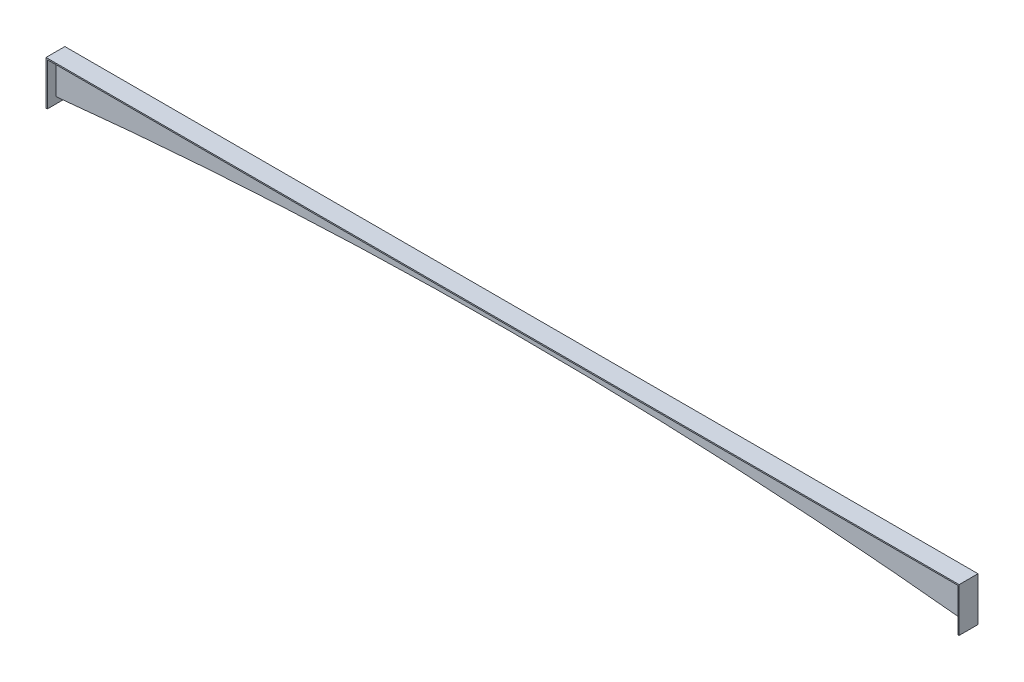
ISO-10303-21;
HEADER;
FILE_DESCRIPTION(('STEP AP214'),'2;1');
FILE_NAME('part.step','',(''),(''),'','','');
FILE_SCHEMA(('AUTOMOTIVE_DESIGN { 1 0 10303 214 1 1 1 1 }'));
ENDSEC;
DATA;
#1=APPLICATION_CONTEXT('core data for automotive mechanical design processes');
#2=APPLICATION_PROTOCOL_DEFINITION('international standard','automotive_design',2000,#1);
#3=PRODUCT_CONTEXT('',#1,'mechanical');
#4=PRODUCT('Part','Part','',(#3));
#5=PRODUCT_RELATED_PRODUCT_CATEGORY('part','',(#4));
#6=PRODUCT_DEFINITION_FORMATION('','',#4);
#7=PRODUCT_DEFINITION_CONTEXT('part definition',#1,'design');
#8=PRODUCT_DEFINITION('design','',#6,#7);
#9=PRODUCT_DEFINITION_SHAPE('','',#8);
#10=(LENGTH_UNIT() NAMED_UNIT(*) SI_UNIT(.MILLI.,.METRE.));
#11=(NAMED_UNIT(*) PLANE_ANGLE_UNIT() SI_UNIT($,.RADIAN.));
#12=(NAMED_UNIT(*) SI_UNIT($,.STERADIAN.) SOLID_ANGLE_UNIT());
#13=UNCERTAINTY_MEASURE_WITH_UNIT(LENGTH_MEASURE(1.E-05),#10,'distance_accuracy_value','');
#14=(GEOMETRIC_REPRESENTATION_CONTEXT(3) GLOBAL_UNCERTAINTY_ASSIGNED_CONTEXT((#13)) GLOBAL_UNIT_ASSIGNED_CONTEXT((#10,
#11,#12)) REPRESENTATION_CONTEXT('',''));
#15=CARTESIAN_POINT('',(0.,0.,0.));
#16=DIRECTION('',(0.,0.,1.));
#17=DIRECTION('',(1.,0.,0.));
#18=AXIS2_PLACEMENT_3D('',#15,#16,#17);
#19=CARTESIAN_POINT('',(-919.00375,86.36,19.05));
#20=DIRECTION('',(0.,1.,0.));
#21=DIRECTION('',(0.,0.,1.));
#22=AXIS2_PLACEMENT_3D('',#19,#20,#21);
#23=PLANE('',#22);
#24=DIRECTION('',(1.,0.,0.));
#25=VECTOR('',#24,1.);
#26=CARTESIAN_POINT('',(-919.00375,86.36,-1.27));
#27=LINE('',#26,#25);
#28=CARTESIAN_POINT('',(-919.00375,86.36,-1.26999999999999));
#29=VERTEX_POINT('',#28);
#30=CARTESIAN_POINT('',(919.00375,86.36,-1.26999999999999));
#31=VERTEX_POINT('',#30);
#32=EDGE_CURVE('E137',#29,#31,#27,.T.);
#33=ORIENTED_EDGE('',*,*,#32,.F.);
#34=DIRECTION('',(0.,0.,-1.));
#35=VECTOR('',#34,1.);
#36=CARTESIAN_POINT('',(-919.00375,86.36,19.05));
#37=LINE('',#36,#35);
#38=CARTESIAN_POINT('',(-919.00375,86.36,-19.05));
#39=VERTEX_POINT('',#38);
#40=EDGE_CURVE('E203',#29,#39,#37,.T.);
#41=ORIENTED_EDGE('',*,*,#40,.T.);
#42=DIRECTION('',(1.,0.,0.));
#43=VECTOR('',#42,1.);
#44=CARTESIAN_POINT('',(-919.00375,86.36,-19.05));
#45=LINE('',#44,#43);
#46=CARTESIAN_POINT('',(919.00375,86.36,-19.05));
#47=VERTEX_POINT('',#46);
#48=EDGE_CURVE('E189',#39,#47,#45,.T.);
#49=ORIENTED_EDGE('',*,*,#48,.T.);
#50=DIRECTION('',(0.,0.,-1.));
#51=VECTOR('',#50,1.);
#52=CARTESIAN_POINT('',(919.00375,86.36,19.05));
#53=LINE('',#52,#51);
#54=EDGE_CURVE('E200',#31,#47,#53,.T.);
#55=ORIENTED_EDGE('',*,*,#54,.F.);
#56=EDGE_LOOP('',(#33,#41,#49,#55));
#57=FACE_BOUND('',#56,.T.);
#58=ADVANCED_FACE('F41',(#57),#23,.F.);
#59=CARTESIAN_POINT('',(921.54375,88.9,19.05));
#60=DIRECTION('',(-1.,0.,0.));
#61=DIRECTION('',(0.,0.,1.));
#62=AXIS2_PLACEMENT_3D('',#59,#60,#61);
#63=PLANE('',#62);
#64=DIRECTION('',(0.,1.,0.));
#65=VECTOR('',#64,1.);
#66=CARTESIAN_POINT('',(921.54375,88.9,-19.05));
#67=LINE('',#66,#65);
#68=CARTESIAN_POINT('',(921.54375,0.,-19.05));
#69=VERTEX_POINT('',#68);
#70=CARTESIAN_POINT('',(921.54375,88.9,-19.05));
#71=VERTEX_POINT('',#70);
#72=EDGE_CURVE('E157',#69,#71,#67,.T.);
#73=ORIENTED_EDGE('',*,*,#72,.T.);
#74=DIRECTION('',(0.,0.,-1.));
#75=VECTOR('',#74,1.);
#76=CARTESIAN_POINT('',(921.54375,88.9,19.05));
#77=LINE('',#76,#75);
#78=CARTESIAN_POINT('',(921.54375,88.9,19.05));
#79=VERTEX_POINT('',#78);
#80=EDGE_CURVE('E144',#79,#71,#77,.T.);
#81=ORIENTED_EDGE('',*,*,#80,.F.);
#82=DIRECTION('',(0.,1.,0.));
#83=VECTOR('',#82,1.);
#84=CARTESIAN_POINT('',(921.54375,88.9,19.05));
#85=LINE('',#84,#83);
#86=CARTESIAN_POINT('',(921.54375,0.,19.05));
#87=VERTEX_POINT('',#86);
#88=EDGE_CURVE('E158',#87,#79,#85,.T.);
#89=ORIENTED_EDGE('',*,*,#88,.F.);
#90=DIRECTION('',(0.,0.,-1.));
#91=VECTOR('',#90,1.);
#92=CARTESIAN_POINT('',(921.54375,0.,19.05));
#93=LINE('',#92,#91);
#94=EDGE_CURVE('E176',#87,#69,#93,.T.);
#95=ORIENTED_EDGE('',*,*,#94,.T.);
#96=EDGE_LOOP('',(#73,#81,#89,#95));
#97=FACE_BOUND('',#96,.T.);
#98=ADVANCED_FACE('F43',(#97),#63,.F.);
#99=CARTESIAN_POINT('',(-921.54375,88.9,19.05));
#100=DIRECTION('',(0.,-1.,0.));
#101=DIRECTION('',(0.,0.,-1.));
#102=AXIS2_PLACEMENT_3D('',#99,#100,#101);
#103=PLANE('',#102);
#104=ORIENTED_EDGE('',*,*,#80,.T.);
#105=DIRECTION('',(-1.,0.,0.));
#106=VECTOR('',#105,1.);
#107=CARTESIAN_POINT('',(-921.54375,88.9,-19.05));
#108=LINE('',#107,#106);
#109=CARTESIAN_POINT('',(-921.54375,88.9,-19.05));
#110=VERTEX_POINT('',#109);
#111=EDGE_CURVE('E179',#71,#110,#108,.T.);
#112=ORIENTED_EDGE('',*,*,#111,.T.);
#113=DIRECTION('',(0.,0.,-1.));
#114=VECTOR('',#113,1.);
#115=CARTESIAN_POINT('',(-921.54375,88.9,19.05));
#116=LINE('',#115,#114);
#117=CARTESIAN_POINT('',(-921.54375,88.9,19.05));
#118=VERTEX_POINT('',#117);
#119=EDGE_CURVE('E213',#118,#110,#116,.T.);
#120=ORIENTED_EDGE('',*,*,#119,.F.);
#121=DIRECTION('',(-1.,0.,0.));
#122=VECTOR('',#121,1.);
#123=CARTESIAN_POINT('',(-921.54375,88.9,19.05));
#124=LINE('',#123,#122);
#125=EDGE_CURVE('E161',#79,#118,#124,.T.);
#126=ORIENTED_EDGE('',*,*,#125,.F.);
#127=EDGE_LOOP('',(#104,#112,#120,#126));
#128=FACE_BOUND('',#127,.T.);
#129=ADVANCED_FACE('F218',(#128),#103,.F.);
#130=CARTESIAN_POINT('',(-921.54375,88.9,19.05));
#131=DIRECTION('',(1.,0.,0.));
#132=DIRECTION('',(0.,0.,-1.));
#133=AXIS2_PLACEMENT_3D('',#130,#131,#132);
#134=PLANE('',#133);
#135=ORIENTED_EDGE('',*,*,#119,.T.);
#136=DIRECTION('',(0.,-1.,0.));
#137=VECTOR('',#136,1.);
#138=CARTESIAN_POINT('',(-921.54375,88.9,-19.05));
#139=LINE('',#138,#137);
#140=CARTESIAN_POINT('',(-921.54375,0.,-19.05));
#141=VERTEX_POINT('',#140);
#142=EDGE_CURVE('E182',#110,#141,#139,.T.);
#143=ORIENTED_EDGE('',*,*,#142,.T.);
#144=DIRECTION('',(0.,0.,-1.));
#145=VECTOR('',#144,1.);
#146=CARTESIAN_POINT('',(-921.54375,0.,19.05));
#147=LINE('',#146,#145);
#148=CARTESIAN_POINT('',(-921.54375,0.,19.05));
#149=VERTEX_POINT('',#148);
#150=EDGE_CURVE('E210',#149,#141,#147,.T.);
#151=ORIENTED_EDGE('',*,*,#150,.F.);
#152=DIRECTION('',(0.,-1.,0.));
#153=VECTOR('',#152,1.);
#154=CARTESIAN_POINT('',(-921.54375,88.9,19.05));
#155=LINE('',#154,#153);
#156=EDGE_CURVE('E164',#118,#149,#155,.T.);
#157=ORIENTED_EDGE('',*,*,#156,.F.);
#158=EDGE_LOOP('',(#135,#143,#151,#157));
#159=FACE_BOUND('',#158,.T.);
#160=ADVANCED_FACE('F247',(#159),#134,.F.);
#161=CARTESIAN_POINT('',(-921.54375,0.,19.05));
#162=DIRECTION('',(0.,1.,0.));
#163=DIRECTION('',(-1.,0.,0.));
#164=AXIS2_PLACEMENT_3D('',#161,#162,#163);
#165=PLANE('',#164);
#166=DIRECTION('',(1.,0.,0.));
#167=VECTOR('',#166,1.);
#168=CARTESIAN_POINT('',(-921.54375,0.,-19.05));
#169=LINE('',#168,#167);
#170=CARTESIAN_POINT('',(-919.00375,0.,-19.05));
#171=VERTEX_POINT('',#170);
#172=EDGE_CURVE('E184',#141,#171,#169,.T.);
#173=ORIENTED_EDGE('',*,*,#172,.T.);
#174=DIRECTION('',(0.,0.,-1.));
#175=VECTOR('',#174,1.);
#176=CARTESIAN_POINT('',(-919.00375,0.,19.05));
#177=LINE('',#176,#175);
#178=CARTESIAN_POINT('',(-919.00375,0.,19.05));
#179=VERTEX_POINT('',#178);
#180=EDGE_CURVE('E207',#179,#171,#177,.T.);
#181=ORIENTED_EDGE('',*,*,#180,.F.);
#182=DIRECTION('',(1.,0.,0.));
#183=VECTOR('',#182,1.);
#184=CARTESIAN_POINT('',(-921.54375,0.,19.05));
#185=LINE('',#184,#183);
#186=EDGE_CURVE('E166',#149,#179,#185,.T.);
#187=ORIENTED_EDGE('',*,*,#186,.F.);
#188=ORIENTED_EDGE('',*,*,#150,.T.);
#189=EDGE_LOOP('',(#173,#181,#187,#188));
#190=FACE_BOUND('',#189,.T.);
#191=ADVANCED_FACE('F242',(#190),#165,.F.);
#192=CARTESIAN_POINT('',(-919.00375,86.36,19.05));
#193=DIRECTION('',(-1.,0.,0.));
#194=DIRECTION('',(0.,0.,1.));
#195=AXIS2_PLACEMENT_3D('',#192,#193,#194);
#196=PLANE('',#195);
#197=DIRECTION('',(0.,0.,1.));
#198=VECTOR('',#197,1.);
#199=CARTESIAN_POINT('',(-919.003749999999,12.7000000000006,0.));
#200=LINE('',#199,#198);
#201=CARTESIAN_POINT('',(-919.00375,12.6999999999988,-1.27));
#202=VERTEX_POINT('',#201);
#203=CARTESIAN_POINT('',(-919.00375,12.699999999997,1.27));
#204=VERTEX_POINT('',#203);
#205=EDGE_CURVE('E56',#202,#204,#200,.T.);
#206=ORIENTED_EDGE('',*,*,#205,.T.);
#207=DIRECTION('',(0.,1.,0.));
#208=VECTOR('',#207,1.);
#209=CARTESIAN_POINT('',(-919.00375,86.36,1.27));
#210=LINE('',#209,#208);
#211=CARTESIAN_POINT('',(-919.00375,86.36,1.27000000000001));
#212=VERTEX_POINT('',#211);
#213=EDGE_CURVE('E155',#204,#212,#210,.T.);
#214=ORIENTED_EDGE('',*,*,#213,.T.);
#215=CARTESIAN_POINT('',(-919.00375,86.36,19.05));
#216=VERTEX_POINT('',#215);
#217=EDGE_CURVE('E204',#216,#212,#37,.T.);
#218=ORIENTED_EDGE('',*,*,#217,.F.);
#219=DIRECTION('',(0.,1.,0.));
#220=VECTOR('',#219,1.);
#221=CARTESIAN_POINT('',(-919.00375,86.36,19.05));
#222=LINE('',#221,#220);
#223=EDGE_CURVE('E168',#179,#216,#222,.T.);
#224=ORIENTED_EDGE('',*,*,#223,.F.);
#225=ORIENTED_EDGE('',*,*,#180,.T.);
#226=DIRECTION('',(0.,1.,0.));
#227=VECTOR('',#226,1.);
#228=CARTESIAN_POINT('',(-919.00375,86.36,-19.05));
#229=LINE('',#228,#227);
#230=EDGE_CURVE('E186',#171,#39,#229,.T.);
#231=ORIENTED_EDGE('',*,*,#230,.T.);
#232=ORIENTED_EDGE('',*,*,#40,.F.);
#233=DIRECTION('',(0.,1.,0.));
#234=VECTOR('',#233,1.);
#235=CARTESIAN_POINT('',(-919.00375,86.36,-1.27));
#236=LINE('',#235,#234);
#237=EDGE_CURVE('E61',#202,#29,#236,.T.);
#238=ORIENTED_EDGE('',*,*,#237,.F.);
#239=EDGE_LOOP('',(#206,#214,#218,#224,#225,#231,#232,#238));
#240=FACE_BOUND('',#239,.T.);
#241=ADVANCED_FACE('F238',(#240),#196,.F.);
#242=ORIENTED_EDGE('',*,*,#217,.T.);
#243=DIRECTION('',(1.,0.,0.));
#244=VECTOR('',#243,1.);
#245=CARTESIAN_POINT('',(-919.00375,86.36,1.27));
#246=LINE('',#245,#244);
#247=CARTESIAN_POINT('',(919.00375,86.36,1.27000000000001));
#248=VERTEX_POINT('',#247);
#249=EDGE_CURVE('E153',#212,#248,#246,.T.);
#250=ORIENTED_EDGE('',*,*,#249,.T.);
#251=CARTESIAN_POINT('',(919.00375,86.36,19.05));
#252=VERTEX_POINT('',#251);
#253=EDGE_CURVE('E201',#252,#248,#53,.T.);
#254=ORIENTED_EDGE('',*,*,#253,.F.);
#255=DIRECTION('',(1.,0.,0.));
#256=VECTOR('',#255,1.);
#257=CARTESIAN_POINT('',(-919.00375,86.36,19.05));
#258=LINE('',#257,#256);
#259=EDGE_CURVE('E170',#216,#252,#258,.T.);
#260=ORIENTED_EDGE('',*,*,#259,.F.);
#261=EDGE_LOOP('',(#242,#250,#254,#260));
#262=FACE_BOUND('',#261,.T.);
#263=ADVANCED_FACE('F257',(#262),#23,.F.);
#264=CARTESIAN_POINT('',(919.00375,86.36,19.05));
#265=DIRECTION('',(1.,0.,0.));
#266=DIRECTION('',(0.,0.,-1.));
#267=AXIS2_PLACEMENT_3D('',#264,#265,#266);
#268=PLANE('',#267);
#269=ORIENTED_EDGE('',*,*,#253,.T.);
#270=DIRECTION('',(0.,-1.,0.));
#271=VECTOR('',#270,1.);
#272=CARTESIAN_POINT('',(919.00375,86.36,1.27));
#273=LINE('',#272,#271);
#274=CARTESIAN_POINT('',(919.00375,12.699999999997,1.27));
#275=VERTEX_POINT('',#274);
#276=EDGE_CURVE('E11',#248,#275,#273,.T.);
#277=ORIENTED_EDGE('',*,*,#276,.T.);
#278=DIRECTION('',(0.,0.,1.));
#279=VECTOR('',#278,1.);
#280=CARTESIAN_POINT('',(919.00375,12.7000000000006,0.));
#281=LINE('',#280,#279);
#282=CARTESIAN_POINT('',(919.00375,12.7000000000006,-1.27));
#283=VERTEX_POINT('',#282);
#284=EDGE_CURVE('E127',#283,#275,#281,.T.);
#285=ORIENTED_EDGE('',*,*,#284,.F.);
#286=DIRECTION('',(0.,-1.,0.));
#287=VECTOR('',#286,1.);
#288=CARTESIAN_POINT('',(919.00375,86.36,-1.27));
#289=LINE('',#288,#287);
#290=EDGE_CURVE('E49',#31,#283,#289,.T.);
#291=ORIENTED_EDGE('',*,*,#290,.F.);
#292=ORIENTED_EDGE('',*,*,#54,.T.);
#293=DIRECTION('',(0.,-1.,0.));
#294=VECTOR('',#293,1.);
#295=CARTESIAN_POINT('',(919.00375,86.36,-19.05));
#296=LINE('',#295,#294);
#297=CARTESIAN_POINT('',(919.00375,0.,-19.05));
#298=VERTEX_POINT('',#297);
#299=EDGE_CURVE('E192',#47,#298,#296,.T.);
#300=ORIENTED_EDGE('',*,*,#299,.T.);
#301=DIRECTION('',(0.,0.,-1.));
#302=VECTOR('',#301,1.);
#303=CARTESIAN_POINT('',(919.00375,0.,19.05));
#304=LINE('',#303,#302);
#305=CARTESIAN_POINT('',(919.00375,0.,19.05));
#306=VERTEX_POINT('',#305);
#307=EDGE_CURVE('E197',#306,#298,#304,.T.);
#308=ORIENTED_EDGE('',*,*,#307,.F.);
#309=DIRECTION('',(0.,-1.,0.));
#310=VECTOR('',#309,1.);
#311=CARTESIAN_POINT('',(919.00375,86.36,19.05));
#312=LINE('',#311,#310);
#313=EDGE_CURVE('E172',#252,#306,#312,.T.);
#314=ORIENTED_EDGE('',*,*,#313,.F.);
#315=EDGE_LOOP('',(#269,#277,#285,#291,#292,#300,#308,#314));
#316=FACE_BOUND('',#315,.T.);
#317=ADVANCED_FACE('F130',(#316),#268,.F.);
#318=CARTESIAN_POINT('',(921.54375,0.,19.05));
#319=DIRECTION('',(0.,1.,0.));
#320=DIRECTION('',(-1.,0.,0.));
#321=AXIS2_PLACEMENT_3D('',#318,#319,#320);
#322=PLANE('',#321);
#323=DIRECTION('',(1.,0.,0.));
#324=VECTOR('',#323,1.);
#325=CARTESIAN_POINT('',(921.54375,0.,-19.05));
#326=LINE('',#325,#324);
#327=EDGE_CURVE('E162',#298,#69,#326,.T.);
#328=ORIENTED_EDGE('',*,*,#327,.T.);
#329=ORIENTED_EDGE('',*,*,#94,.F.);
#330=DIRECTION('',(1.,0.,0.));
#331=VECTOR('',#330,1.);
#332=CARTESIAN_POINT('',(921.54375,0.,19.05));
#333=LINE('',#332,#331);
#334=EDGE_CURVE('E174',#306,#87,#333,.T.);
#335=ORIENTED_EDGE('',*,*,#334,.F.);
#336=ORIENTED_EDGE('',*,*,#307,.T.);
#337=EDGE_LOOP('',(#328,#329,#335,#336));
#338=FACE_BOUND('',#337,.T.);
#339=ADVANCED_FACE('F231',(#338),#322,.F.);
#340=CARTESIAN_POINT('',(0.,0.,19.05));
#341=DIRECTION('',(0.,0.,-1.));
#342=DIRECTION('',(-1.,0.,0.));
#343=AXIS2_PLACEMENT_3D('',#340,#341,#342);
#344=PLANE('',#343);
#345=ORIENTED_EDGE('',*,*,#88,.T.);
#346=ORIENTED_EDGE('',*,*,#125,.T.);
#347=ORIENTED_EDGE('',*,*,#156,.T.);
#348=ORIENTED_EDGE('',*,*,#186,.T.);
#349=ORIENTED_EDGE('',*,*,#223,.T.);
#350=ORIENTED_EDGE('',*,*,#259,.T.);
#351=ORIENTED_EDGE('',*,*,#313,.T.);
#352=ORIENTED_EDGE('',*,*,#334,.T.);
#353=EDGE_LOOP('',(#345,#346,#347,#348,#349,#350,#351,#352));
#354=FACE_BOUND('',#353,.T.);
#355=ADVANCED_FACE('F249',(#354),#344,.F.);
#356=CARTESIAN_POINT('',(0.,0.,-19.05));
#357=DIRECTION('',(0.,0.,-1.));
#358=DIRECTION('',(-1.,0.,0.));
#359=AXIS2_PLACEMENT_3D('',#356,#357,#358);
#360=PLANE('',#359);
#361=ORIENTED_EDGE('',*,*,#72,.F.);
#362=ORIENTED_EDGE('',*,*,#327,.F.);
#363=ORIENTED_EDGE('',*,*,#299,.F.);
#364=ORIENTED_EDGE('',*,*,#48,.F.);
#365=ORIENTED_EDGE('',*,*,#230,.F.);
#366=ORIENTED_EDGE('',*,*,#172,.F.);
#367=ORIENTED_EDGE('',*,*,#142,.F.);
#368=ORIENTED_EDGE('',*,*,#111,.F.);
#369=EDGE_LOOP('',(#361,#362,#363,#364,#365,#366,#367,#368));
#370=FACE_BOUND('',#369,.T.);
#371=ADVANCED_FACE('F225',(#370),#360,.T.);
#372=CARTESIAN_POINT('',(0.,44.45,1.27));
#373=DIRECTION('',(0.,0.,1.));
#374=DIRECTION('',(1.,0.,0.));
#375=AXIS2_PLACEMENT_3D('',#372,#373,#374);
#376=PLANE('',#375);
#377=ORIENTED_EDGE('',*,*,#213,.F.);
#378=CARTESIAN_POINT('',(0.,-8713.35537623355,1.27));
#379=DIRECTION('',(0.,0.,-1.));
#380=DIRECTION('',(-1.,0.,0.));
#381=AXIS2_PLACEMENT_3D('',#378,#379,#380);
#382=CIRCLE('',#381,8774.31537623355);
#383=EDGE_CURVE('E146',#204,#275,#382,.T.);
#384=ORIENTED_EDGE('',*,*,#383,.T.);
#385=ORIENTED_EDGE('',*,*,#276,.F.);
#386=ORIENTED_EDGE('',*,*,#249,.F.);
#387=EDGE_LOOP('',(#377,#384,#385,#386));
#388=FACE_BOUND('',#387,.T.);
#389=ADVANCED_FACE('F255',(#388),#376,.T.);
#390=CARTESIAN_POINT('',(0.,44.45,-1.27));
#391=DIRECTION('',(0.,0.,1.));
#392=DIRECTION('',(1.,0.,0.));
#393=AXIS2_PLACEMENT_3D('',#390,#391,#392);
#394=PLANE('',#393);
#395=CARTESIAN_POINT('',(0.,-8713.35537623355,-1.27));
#396=DIRECTION('',(0.,0.,-1.));
#397=DIRECTION('',(-1.,0.,0.));
#398=AXIS2_PLACEMENT_3D('',#395,#396,#397);
#399=CIRCLE('',#398,8774.31537623355);
#400=EDGE_CURVE('E143',#202,#283,#399,.T.);
#401=ORIENTED_EDGE('',*,*,#400,.F.);
#402=ORIENTED_EDGE('',*,*,#237,.T.);
#403=ORIENTED_EDGE('',*,*,#32,.T.);
#404=ORIENTED_EDGE('',*,*,#290,.T.);
#405=EDGE_LOOP('',(#401,#402,#403,#404));
#406=FACE_BOUND('',#405,.T.);
#407=ADVANCED_FACE('F142',(#406),#394,.F.);
#408=CARTESIAN_POINT('',(0.,-8713.35537623355,0.));
#409=DIRECTION('',(0.,0.,-1.));
#410=DIRECTION('',(-1.,0.,0.));
#411=AXIS2_PLACEMENT_3D('',#408,#409,#410);
#412=CYLINDRICAL_SURFACE('',#411,8774.31537623355);
#413=ORIENTED_EDGE('',*,*,#400,.T.);
#414=ORIENTED_EDGE('',*,*,#284,.T.);
#415=ORIENTED_EDGE('',*,*,#383,.F.);
#416=ORIENTED_EDGE('',*,*,#205,.F.);
#417=EDGE_LOOP('',(#413,#414,#415,#416));
#418=FACE_BOUND('',#417,.T.);
#419=ADVANCED_FACE('F145',(#418),#412,.F.);
#420=CLOSED_SHELL('',(#58,#98,#129,#160,#191,#241,#263,#317,#339,#355,#371,#389,#407,#419));
#421=MANIFOLD_SOLID_BREP('B2',#420);
#422=ADVANCED_BREP_SHAPE_REPRESENTATION('',(#18,#421),#14);
#423=SHAPE_DEFINITION_REPRESENTATION(#9,#422);
ENDSEC;
END-ISO-10303-21;
